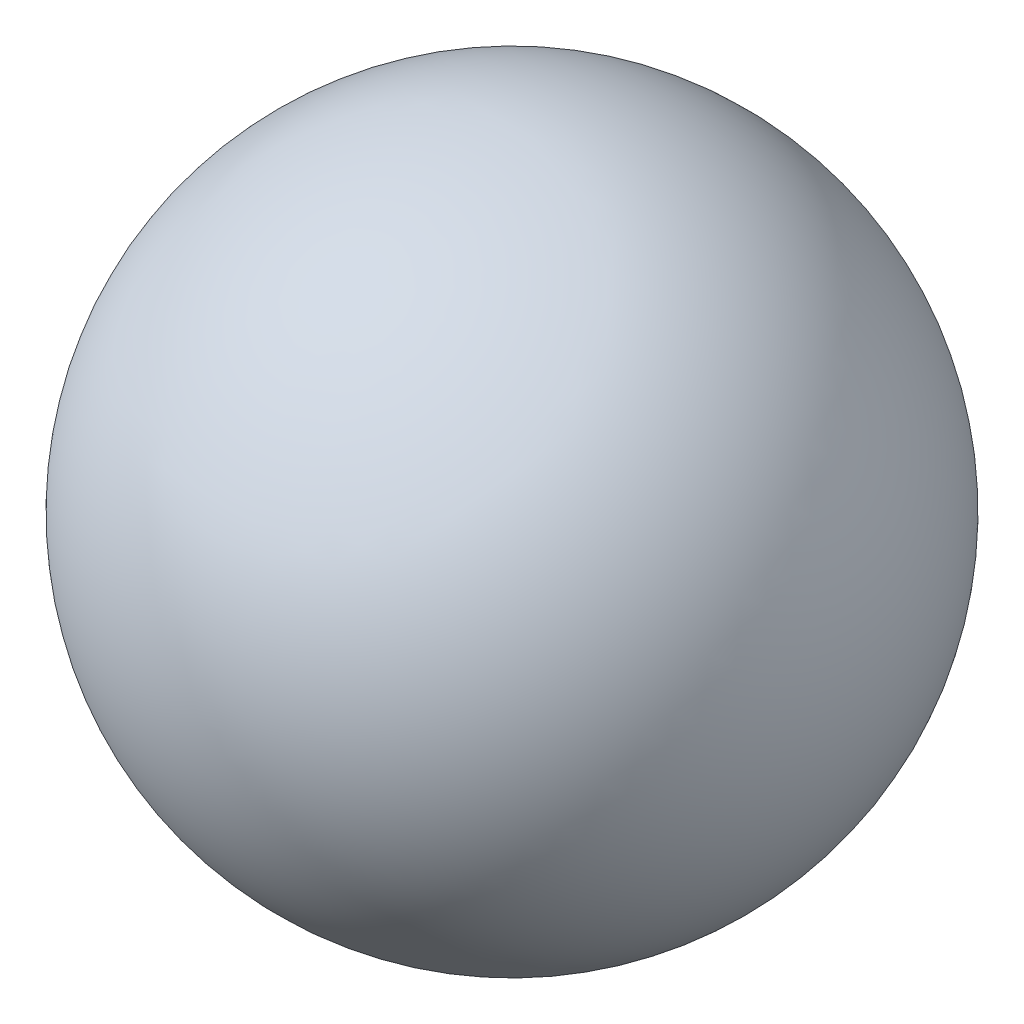
ISO-10303-21;
HEADER;
FILE_DESCRIPTION(('STEP AP214'),'2;1');
FILE_NAME('part.step','',(''),(''),'','','');
FILE_SCHEMA(('AUTOMOTIVE_DESIGN { 1 0 10303 214 1 1 1 1 }'));
ENDSEC;
DATA;
#1=APPLICATION_CONTEXT('core data for automotive mechanical design processes');
#2=APPLICATION_PROTOCOL_DEFINITION('international standard','automotive_design',2000,#1);
#3=PRODUCT_CONTEXT('',#1,'mechanical');
#4=PRODUCT('Part','Part','',(#3));
#5=PRODUCT_RELATED_PRODUCT_CATEGORY('part','',(#4));
#6=PRODUCT_DEFINITION_FORMATION('','',#4);
#7=PRODUCT_DEFINITION_CONTEXT('part definition',#1,'design');
#8=PRODUCT_DEFINITION('design','',#6,#7);
#9=PRODUCT_DEFINITION_SHAPE('','',#8);
#10=(LENGTH_UNIT() NAMED_UNIT(*) SI_UNIT(.MILLI.,.METRE.));
#11=(NAMED_UNIT(*) PLANE_ANGLE_UNIT() SI_UNIT($,.RADIAN.));
#12=(NAMED_UNIT(*) SI_UNIT($,.STERADIAN.) SOLID_ANGLE_UNIT());
#13=UNCERTAINTY_MEASURE_WITH_UNIT(LENGTH_MEASURE(1.E-05),#10,'distance_accuracy_value','');
#14=(GEOMETRIC_REPRESENTATION_CONTEXT(3) GLOBAL_UNCERTAINTY_ASSIGNED_CONTEXT((#13)) GLOBAL_UNIT_ASSIGNED_CONTEXT((#10,
#11,#12)) REPRESENTATION_CONTEXT('',''));
#15=CARTESIAN_POINT('',(0.,0.,0.));
#16=DIRECTION('',(0.,0.,1.));
#17=DIRECTION('',(1.,0.,0.));
#18=AXIS2_PLACEMENT_3D('',#15,#16,#17);
#19=CARTESIAN_POINT('',(67.76,51.0927734257606,-46.8892765983214));
#20=DIRECTION('',(0.,0.736764460517836,-0.676149487700658));
#21=DIRECTION('',(0.173648177666933,0.66587725768284,0.725571352861821));
#22=AXIS2_PLACEMENT_3D('',#19,#20,#21);
#23=SPHERICAL_SURFACE('',#22,7.15);
#24=CARTESIAN_POINT('',(67.76,56.3606393184631,-51.7237454353811));
#25=VERTEX_POINT('',#24);
#26=VERTEX_LOOP('',#25);
#27=FACE_BOUND('',#26,.T.);
#28=CARTESIAN_POINT('',(67.76,45.8249075330581,-42.0548077612617));
#29=VERTEX_POINT('',#28);
#30=VERTEX_LOOP('',#29);
#31=FACE_BOUND('',#30,.T.);
#32=ADVANCED_FACE('F16',(#27,#31),#23,.T.);
#33=CLOSED_SHELL('',(#32));
#34=MANIFOLD_SOLID_BREP('B1',#33);
#35=ADVANCED_BREP_SHAPE_REPRESENTATION('',(#18,#34),#14);
#36=SHAPE_DEFINITION_REPRESENTATION(#9,#35);
ENDSEC;
END-ISO-10303-21;
